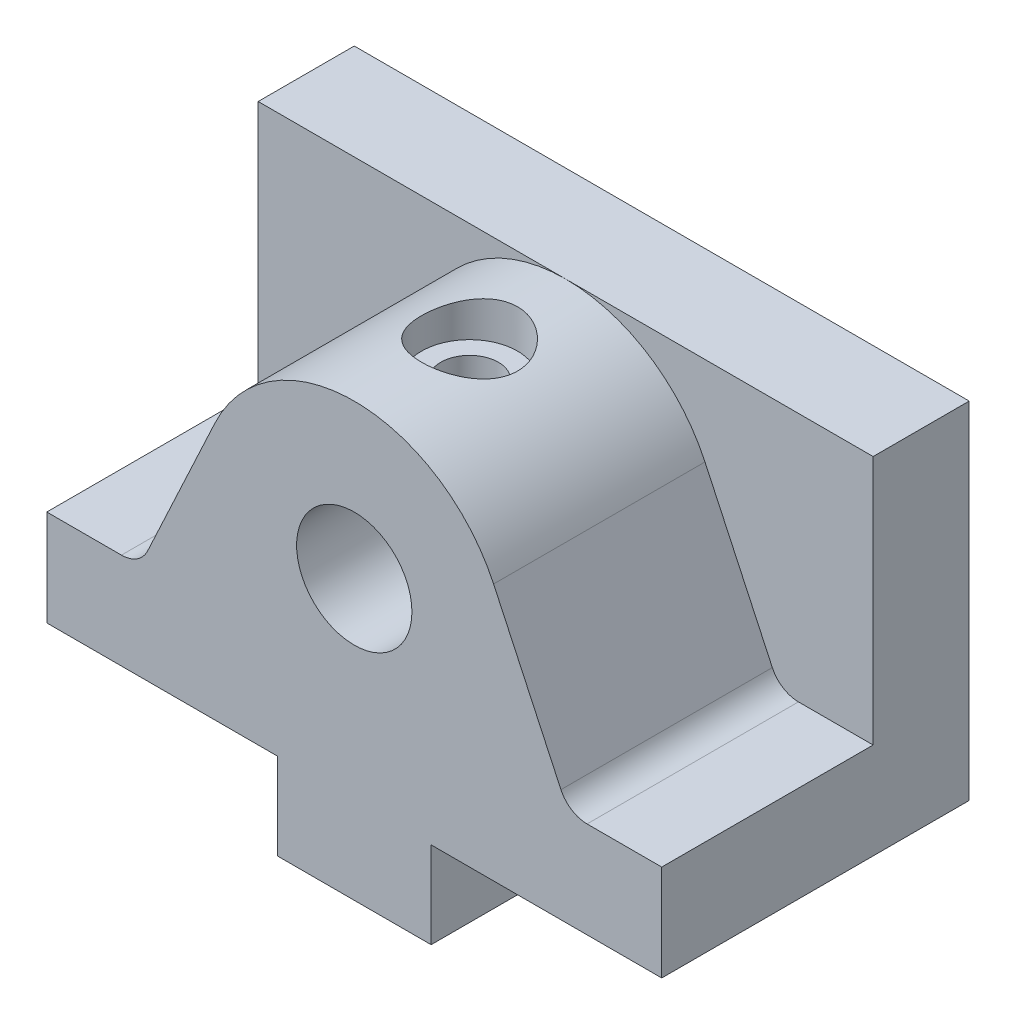
ISO-10303-21;
HEADER;
FILE_DESCRIPTION(('STEP AP214'),'2;1');
FILE_NAME('part.step','',(''),(''),'','','');
FILE_SCHEMA(('AUTOMOTIVE_DESIGN { 1 0 10303 214 1 1 1 1 }'));
ENDSEC;
DATA;
#1=APPLICATION_CONTEXT('core data for automotive mechanical design processes');
#2=APPLICATION_PROTOCOL_DEFINITION('international standard','automotive_design',2000,#1);
#3=PRODUCT_CONTEXT('',#1,'mechanical');
#4=PRODUCT('Part','Part','',(#3));
#5=PRODUCT_RELATED_PRODUCT_CATEGORY('part','',(#4));
#6=PRODUCT_DEFINITION_FORMATION('','',#4);
#7=PRODUCT_DEFINITION_CONTEXT('part definition',#1,'design');
#8=PRODUCT_DEFINITION('design','',#6,#7);
#9=PRODUCT_DEFINITION_SHAPE('','',#8);
#10=(LENGTH_UNIT() NAMED_UNIT(*) SI_UNIT(.MILLI.,.METRE.));
#11=(NAMED_UNIT(*) PLANE_ANGLE_UNIT() SI_UNIT($,.RADIAN.));
#12=(NAMED_UNIT(*) SI_UNIT($,.STERADIAN.) SOLID_ANGLE_UNIT());
#13=UNCERTAINTY_MEASURE_WITH_UNIT(LENGTH_MEASURE(1.E-05),#10,'distance_accuracy_value','');
#14=(GEOMETRIC_REPRESENTATION_CONTEXT(3) GLOBAL_UNCERTAINTY_ASSIGNED_CONTEXT((#13)) GLOBAL_UNIT_ASSIGNED_CONTEXT((#10,
#11,#12)) REPRESENTATION_CONTEXT('',''));
#15=CARTESIAN_POINT('',(0.,0.,0.));
#16=DIRECTION('',(0.,0.,1.));
#17=DIRECTION('',(1.,0.,0.));
#18=AXIS2_PLACEMENT_3D('',#15,#16,#17);
#19=CARTESIAN_POINT('',(48.4459707787607,22.5907271808898,22.));
#20=DIRECTION('',(0.906307787036647,0.422618261740707,0.));
#21=DIRECTION('',(-0.422618261740707,0.906307787036646,0.));
#22=AXIS2_PLACEMENT_3D('',#19,#20,#21);
#23=PLANE('',#22);
#24=DIRECTION('',(0.422618261740707,-0.906307787036647,0.));
#25=VECTOR('',#24,1.);
#26=CARTESIAN_POINT('',(48.4459707787607,22.5907271808898,22.));
#27=LINE('',#26,#25);
#28=CARTESIAN_POINT('',(46.5009245925863,26.7618921878513,22.));
#29=VERTEX_POINT('',#28);
#30=CARTESIAN_POINT('',(53.5094107062625,11.7321452147779,22.));
#31=VERTEX_POINT('',#30);
#32=EDGE_CURVE('E223',#29,#31,#27,.T.);
#33=ORIENTED_EDGE('',*,*,#32,.T.);
#34=DIRECTION('',(0.,0.,-1.));
#35=VECTOR('',#34,1.);
#36=CARTESIAN_POINT('',(53.5094107062625,11.7321452147779,0.));
#37=LINE('',#36,#35);
#38=CARTESIAN_POINT('',(53.5094107062625,11.7321452147779,0.));
#39=VERTEX_POINT('',#38);
#40=EDGE_CURVE('E294',#31,#39,#37,.T.);
#41=ORIENTED_EDGE('',*,*,#40,.T.);
#42=DIRECTION('',(0.422618261740707,-0.906307787036647,0.));
#43=VECTOR('',#42,1.);
#44=CARTESIAN_POINT('',(48.4459707787607,22.5907271808898,0.));
#45=LINE('',#44,#43);
#46=CARTESIAN_POINT('',(46.5009245925863,26.7618921878513,0.));
#47=VERTEX_POINT('',#46);
#48=EDGE_CURVE('E221',#47,#39,#45,.T.);
#49=ORIENTED_EDGE('',*,*,#48,.F.);
#50=DIRECTION('',(0.,0.,-1.));
#51=VECTOR('',#50,1.);
#52=CARTESIAN_POINT('',(46.5009245925863,26.7618921878513,22.));
#53=LINE('',#52,#51);
#54=EDGE_CURVE('E284',#29,#47,#53,.T.);
#55=ORIENTED_EDGE('',*,*,#54,.F.);
#56=EDGE_LOOP('',(#33,#41,#49,#55));
#57=FACE_BOUND('',#56,.T.);
#58=ADVANCED_FACE('F44',(#57),#23,.T.);
#59=CARTESIAN_POINT('',(32.,20.,22.));
#60=DIRECTION('',(0.,0.,-1.));
#61=DIRECTION('',(-1.,0.,0.));
#62=AXIS2_PLACEMENT_3D('',#59,#60,#61);
#63=CYLINDRICAL_SURFACE('',#62,16.);
#64=CARTESIAN_POINT('',(32.,36.,15.));
#65=CARTESIAN_POINT('',(31.7262432593018,35.9999986351195,14.9999982136497));
#66=CARTESIAN_POINT('',(31.4524677899886,35.9929077993933,14.9774430922222));
#67=CARTESIAN_POINT('',(30.9129231616462,35.9653157635526,14.888055033843));
#68=CARTESIAN_POINT('',(30.6471558290963,35.9448115279957,14.8212120745424));
#69=CARTESIAN_POINT('',(30.1314858253969,35.892632627915,14.6457225152172));
#70=CARTESIAN_POINT('',(29.8815592920572,35.860975259956,14.5371406213887));
#71=CARTESIAN_POINT('',(29.4034607906138,35.7897587664487,14.2815307292862));
#72=CARTESIAN_POINT('',(29.1752922582191,35.7501983960149,14.1344966728757));
#73=CARTESIAN_POINT('',(28.7401386601923,35.6660085495921,13.8013760319326));
#74=CARTESIAN_POINT('',(28.5339198873788,35.621268637007,13.6143164597633));
#75=CARTESIAN_POINT('',(28.1552104718466,35.5324018550409,13.2085264303382));
#76=CARTESIAN_POINT('',(27.9827261083849,35.4882751012093,12.9897900899934));
#77=CARTESIAN_POINT('',(27.6722265406936,35.4044457876485,12.5202217447927));
#78=CARTESIAN_POINT('',(27.5351686340689,35.3648795310221,12.2687300899923));
#79=CARTESIAN_POINT('',(27.3056103570076,35.2963120709366,11.7448307401774));
#80=CARTESIAN_POINT('',(27.2130982491415,35.2673080849026,11.4724285768566));
#81=CARTESIAN_POINT('',(27.0780616027814,35.224304279618,10.9230876901663));
#82=CARTESIAN_POINT('',(27.0341155996838,35.2098789171452,10.6465326254318));
#83=CARTESIAN_POINT('',(26.9930177985221,35.1964022056731,10.0896275243652));
#84=CARTESIAN_POINT('',(26.9958535601583,35.1973467694717,9.80927851673902));
#85=CARTESIAN_POINT('',(27.0471270107018,35.2141275626545,9.26450215888891));
#86=CARTESIAN_POINT('',(27.0937576852707,35.229373668447,8.99988349644805));
#87=CARTESIAN_POINT('',(27.2283674658204,35.272081024701,8.48243137375097));
#88=CARTESIAN_POINT('',(27.3163509662281,35.2995435733467,8.2295991691417));
#89=CARTESIAN_POINT('',(27.5324450127348,35.3640417609542,7.73859222230161));
#90=CARTESIAN_POINT('',(27.6611229735129,35.4012113865356,7.5006855572407));
#91=CARTESIAN_POINT('',(27.9545591704899,35.4808742631002,7.04924892847488));
#92=CARTESIAN_POINT('',(28.119326779138,35.523368895754,6.83572531898279));
#93=CARTESIAN_POINT('',(28.4891321832704,35.6112611120491,6.42890022633452));
#94=CARTESIAN_POINT('',(28.6956617176284,35.6567027842357,6.23696176888193));
#95=CARTESIAN_POINT('',(29.1385423676182,35.7436628303753,5.89011242568063));
#96=CARTESIAN_POINT('',(29.374895690604,35.7851809135328,5.735204283123));
#97=CARTESIAN_POINT('',(29.8733415581381,35.8600517956098,5.46588924559509));
#98=CARTESIAN_POINT('',(30.1356203723229,35.8933384259289,5.35180745814418));
#99=CARTESIAN_POINT('',(30.6769280888694,35.9475182331416,5.1697879965937));
#100=CARTESIAN_POINT('',(30.9559518771016,35.9684151730059,5.10183631104642));
#101=CARTESIAN_POINT('',(31.5112593708386,35.9948555758007,5.0163278296841));
#102=CARTESIAN_POINT('',(31.7872326048446,36.0009609158175,4.99692582562591));
#103=CARTESIAN_POINT('',(32.3385212229303,35.9987919892393,5.00386490654933));
#104=CARTESIAN_POINT('',(32.613836697226,35.9905198232454,5.03019930929045));
#105=CARTESIAN_POINT('',(33.1488773319034,35.9608945507905,5.12638237042556));
#106=CARTESIAN_POINT('',(33.4088199136837,35.9398717244275,5.19513307044996));
#107=CARTESIAN_POINT('',(33.9134077154455,35.8872048551716,5.37285740946688));
#108=CARTESIAN_POINT('',(34.1580510417962,35.8555595005738,5.48183601610006));
#109=CARTESIAN_POINT('',(34.6317296266887,35.783941710377,5.73989286619475));
#110=CARTESIAN_POINT('',(34.8602389591512,35.7437850727067,5.88988394998724));
#111=CARTESIAN_POINT('',(35.289463403841,35.6597364001372,6.2246128404697));
#112=CARTESIAN_POINT('',(35.4901709521758,35.6158433539155,6.40936007097857));
#113=CARTESIAN_POINT('',(35.8663498516761,35.5270797953257,6.8170355602084));
#114=CARTESIAN_POINT('',(36.0405060935812,35.4822394682577,7.0411866549569));
#115=CARTESIAN_POINT('',(36.3488500098061,35.3984778838242,7.5165064655071));
#116=CARTESIAN_POINT('',(36.4830383189372,35.3595565324524,7.76767475210794));
#117=CARTESIAN_POINT('',(36.7068033392217,35.2924712932348,8.28938069148191));
#118=CARTESIAN_POINT('',(36.7965527822405,35.264265854275,8.55983859774289));
#119=CARTESIAN_POINT('',(36.9289157727236,35.2220468337724,9.11308997299448));
#120=CARTESIAN_POINT('',(36.9715472565598,35.2080278520491,9.39587870537413));
#121=CARTESIAN_POINT('',(37.007176246325,35.1963317085551,9.95201635032171));
#122=CARTESIAN_POINT('',(37.0023311848654,35.1979441840057,10.2252138153897));
#123=CARTESIAN_POINT('',(36.9483527251533,35.2156036150361,10.7666983397678));
#124=CARTESIAN_POINT('',(36.8992213929005,35.2316498972642,11.0349856275469));
#125=CARTESIAN_POINT('',(36.7595091965447,35.2758725673356,11.5551761583676));
#126=CARTESIAN_POINT('',(36.6695456962403,35.3038679276103,11.8072617643734));
#127=CARTESIAN_POINT('',(36.4512090934,35.3687881701826,12.292961654136));
#128=CARTESIAN_POINT('',(36.3228281777695,35.4057148685869,12.5265721683136));
#129=CARTESIAN_POINT('',(36.0254270005397,35.4861394813401,12.9785838817592));
#130=CARTESIAN_POINT('',(35.8550133409653,35.5298379569183,13.196032518001));
#131=CARTESIAN_POINT('',(35.4808359856192,35.6179599528484,13.599945312448));
#132=CARTESIAN_POINT('',(35.2770633693776,35.6623836642662,13.7864011559642));
#133=CARTESIAN_POINT('',(34.8339466512934,35.7486908780989,14.1291301534517));
#134=CARTESIAN_POINT('',(34.5936582979495,35.7904440692269,14.2842189457998));
#135=CARTESIAN_POINT('',(34.0891165520546,35.8650707718751,14.5515956605578));
#136=CARTESIAN_POINT('',(33.8248726311818,35.8979477726329,14.6639004085673));
#137=CARTESIAN_POINT('',(33.3029905414959,35.9488260293388,14.8343654704338));
#138=CARTESIAN_POINT('',(33.0466813484502,35.9678496322456,14.8962994692213));
#139=CARTESIAN_POINT('',(32.526919581761,35.9934360136194,14.9791134398709));
#140=CARTESIAN_POINT('',(32.2634684645587,36.0000013135858,15.000001719216));
#141=CARTESIAN_POINT('',(32.,36.,15.));
#142=B_SPLINE_CURVE_WITH_KNOTS('',3,(#64,#65,#66,#67,#68,#69,#70,#71,#72,#73,#74,#75,#76,#77,
#78,#79,#80,#81,#82,#83,#84,#85,#86,#87,#88,#89,#90,#91,#92,#93,#94,#95,#96,#97,#98,#99,#100,
#101,#102,#103,#104,#105,#106,#107,#108,#109,#110,#111,#112,#113,#114,#115,#116,#117,#118,#119,
#120,#121,#122,#123,#124,#125,#126,#127,#128,#129,#130,#131,#132,#133,#134,#135,#136,#137,#138,
#139,#140,#141),.UNSPECIFIED.,.T.,.F.,(4,2,2,2,2,2,2,2,2,2,2,2,2,2,2,2,2,2,2,2,2,2,2,2,2,2,2,2,
2,2,2,2,2,2,2,2,2,2,4),(0.,0.820301797730038,1.64078929339626,2.46000991680974,3.27935968623355,
4.12151288780632,4.96382269725104,5.82695084991452,6.68985145121462,7.52676600672194,
8.36345801183907,9.16707669695193,9.97078079925599,10.7862257089153,11.6018826405078,
12.4546698912775,13.3075202966256,14.1670184276843,15.0262553798756,15.8523027420229,
16.678229426068,17.4836250690084,18.2891202014734,19.1142529896272,19.9396098284638,
20.7976711486191,21.6557188394419,22.5104046302277,23.364764955987,24.1804881394266,
24.9961732705187,25.7999165363422,26.6038233736823,27.4391805607298,28.274761495409,
29.1376267255318,30.0001522671288,30.789785466537,31.5792588309973),.UNSPECIFIED.);
#143=CARTESIAN_POINT('',(32.,36.,15.));
#144=VERTEX_POINT('',#143);
#145=EDGE_CURVE('E13',#144,#144,#142,.T.);
#146=ORIENTED_EDGE('',*,*,#145,.T.);
#147=EDGE_LOOP('',(#146));
#148=FACE_BOUND('',#147,.T.);
#149=CARTESIAN_POINT('',(32.,20.,0.));
#150=DIRECTION('',(0.,0.,1.));
#151=DIRECTION('',(1.,0.,0.));
#152=AXIS2_PLACEMENT_3D('',#149,#150,#151);
#153=CIRCLE('',#152,16.);
#154=CARTESIAN_POINT('',(32.,36.,0.));
#155=VERTEX_POINT('',#154);
#156=EDGE_CURVE('E255',#47,#155,#153,.T.);
#157=ORIENTED_EDGE('',*,*,#156,.T.);
#158=CARTESIAN_POINT('',(17.4990754074136,26.7618921878511,0.));
#159=VERTEX_POINT('',#158);
#160=EDGE_CURVE('E254',#155,#159,#153,.T.);
#161=ORIENTED_EDGE('',*,*,#160,.T.);
#162=DIRECTION('',(0.,0.,-1.));
#163=VECTOR('',#162,1.);
#164=CARTESIAN_POINT('',(17.4990754074136,26.7618921878511,22.));
#165=LINE('',#164,#163);
#166=CARTESIAN_POINT('',(17.4990754074136,26.7618921878511,22.));
#167=VERTEX_POINT('',#166);
#168=EDGE_CURVE('E281',#167,#159,#165,.T.);
#169=ORIENTED_EDGE('',*,*,#168,.F.);
#170=CARTESIAN_POINT('',(32.,20.,22.));
#171=DIRECTION('',(0.,0.,1.));
#172=DIRECTION('',(1.,0.,0.));
#173=AXIS2_PLACEMENT_3D('',#170,#171,#172);
#174=CIRCLE('',#173,16.);
#175=EDGE_CURVE('E226',#29,#167,#174,.T.);
#176=ORIENTED_EDGE('',*,*,#175,.F.);
#177=ORIENTED_EDGE('',*,*,#54,.T.);
#178=EDGE_LOOP('',(#157,#161,#169,#176,#177));
#179=FACE_BOUND('',#178,.T.);
#180=ADVANCED_FACE('F322',(#148,#179),#63,.T.);
#181=CARTESIAN_POINT('',(4.12323273120865,-1.92269499891791,22.));
#182=DIRECTION('',(0.906307787036653,-0.422618261740694,0.));
#183=DIRECTION('',(0.422618261740694,0.906307787036653,0.));
#184=AXIS2_PLACEMENT_3D('',#181,#182,#183);
#185=PLANE('',#184);
#186=DIRECTION('',(-0.422618261740694,-0.906307787036653,0.));
#187=VECTOR('',#186,1.);
#188=CARTESIAN_POINT('',(4.12323273120865,-1.92269499891791,0.));
#189=LINE('',#188,#187);
#190=CARTESIAN_POINT('',(10.4905892937377,11.7321452147779,0.));
#191=VERTEX_POINT('',#190);
#192=EDGE_CURVE('E258',#159,#191,#189,.T.);
#193=ORIENTED_EDGE('',*,*,#192,.T.);
#194=DIRECTION('',(0.,0.,-1.));
#195=VECTOR('',#194,1.);
#196=CARTESIAN_POINT('',(10.4905892937377,11.7321452147779,22.));
#197=LINE('',#196,#195);
#198=CARTESIAN_POINT('',(10.4905892937377,11.7321452147779,22.));
#199=VERTEX_POINT('',#198);
#200=EDGE_CURVE('E292',#191,#199,#197,.F.);
#201=ORIENTED_EDGE('',*,*,#200,.T.);
#202=DIRECTION('',(-0.422618261740694,-0.906307787036653,0.));
#203=VECTOR('',#202,1.);
#204=CARTESIAN_POINT('',(4.12323273120865,-1.92269499891791,22.));
#205=LINE('',#204,#203);
#206=EDGE_CURVE('E229',#167,#199,#205,.T.);
#207=ORIENTED_EDGE('',*,*,#206,.F.);
#208=ORIENTED_EDGE('',*,*,#168,.T.);
#209=EDGE_LOOP('',(#193,#201,#207,#208));
#210=FACE_BOUND('',#209,.T.);
#211=ADVANCED_FACE('F327',(#210),#185,.F.);
#212=CARTESIAN_POINT('',(0.,10.,22.));
#213=DIRECTION('',(0.,1.,0.));
#214=DIRECTION('',(0.,0.,1.));
#215=AXIS2_PLACEMENT_3D('',#212,#213,#214);
#216=PLANE('',#215);
#217=DIRECTION('',(1.,0.,0.));
#218=VECTOR('',#217,1.);
#219=CARTESIAN_POINT('',(0.,10.,22.));
#220=LINE('',#219,#218);
#221=CARTESIAN_POINT('',(0.,10.,22.));
#222=VERTEX_POINT('',#221);
#223=CARTESIAN_POINT('',(7.77166593262779,10.,22.));
#224=VERTEX_POINT('',#223);
#225=EDGE_CURVE('E232',#222,#224,#220,.T.);
#226=ORIENTED_EDGE('',*,*,#225,.T.);
#227=DIRECTION('',(0.,0.,-1.));
#228=VECTOR('',#227,1.);
#229=CARTESIAN_POINT('',(7.77166593262779,10.,22.));
#230=LINE('',#229,#228);
#231=CARTESIAN_POINT('',(7.77166593262779,10.,0.));
#232=VERTEX_POINT('',#231);
#233=EDGE_CURVE('E287',#224,#232,#230,.T.);
#234=ORIENTED_EDGE('',*,*,#233,.T.);
#235=DIRECTION('',(1.,0.,0.));
#236=VECTOR('',#235,1.);
#237=CARTESIAN_POINT('',(0.,10.,0.));
#238=LINE('',#237,#236);
#239=CARTESIAN_POINT('',(0.,10.,0.));
#240=VERTEX_POINT('',#239);
#241=EDGE_CURVE('E261',#240,#232,#238,.T.);
#242=ORIENTED_EDGE('',*,*,#241,.F.);
#243=DIRECTION('',(0.,0.,-1.));
#244=VECTOR('',#243,1.);
#245=CARTESIAN_POINT('',(0.,10.,22.));
#246=LINE('',#245,#244);
#247=EDGE_CURVE('E278',#222,#240,#246,.T.);
#248=ORIENTED_EDGE('',*,*,#247,.F.);
#249=EDGE_LOOP('',(#226,#234,#242,#248));
#250=FACE_BOUND('',#249,.T.);
#251=ADVANCED_FACE('F333',(#250),#216,.T.);
#252=CARTESIAN_POINT('',(0.,0.,22.));
#253=DIRECTION('',(-1.,0.,0.));
#254=DIRECTION('',(0.,0.,1.));
#255=AXIS2_PLACEMENT_3D('',#252,#253,#254);
#256=PLANE('',#255);
#257=ORIENTED_EDGE('',*,*,#247,.T.);
#258=DIRECTION('',(0.,1.,0.));
#259=VECTOR('',#258,1.);
#260=CARTESIAN_POINT('',(0.,0.,0.));
#261=LINE('',#260,#259);
#262=CARTESIAN_POINT('',(0.,36.,0.));
#263=VERTEX_POINT('',#262);
#264=EDGE_CURVE('E195',#240,#263,#261,.T.);
#265=ORIENTED_EDGE('',*,*,#264,.T.);
#266=DIRECTION('',(0.,0.,1.));
#267=VECTOR('',#266,1.);
#268=CARTESIAN_POINT('',(0.,36.,-10.));
#269=LINE('',#268,#267);
#270=CARTESIAN_POINT('',(0.,36.,-10.));
#271=VERTEX_POINT('',#270);
#272=EDGE_CURVE('E188',#271,#263,#269,.T.);
#273=ORIENTED_EDGE('',*,*,#272,.F.);
#274=DIRECTION('',(0.,1.,0.));
#275=VECTOR('',#274,1.);
#276=CARTESIAN_POINT('',(0.,0.,-10.));
#277=LINE('',#276,#275);
#278=CARTESIAN_POINT('',(0.,0.,-10.));
#279=VERTEX_POINT('',#278);
#280=EDGE_CURVE('E174',#279,#271,#277,.T.);
#281=ORIENTED_EDGE('',*,*,#280,.F.);
#282=DIRECTION('',(0.,0.,-1.));
#283=VECTOR('',#282,1.);
#284=CARTESIAN_POINT('',(0.,0.,22.));
#285=LINE('',#284,#283);
#286=CARTESIAN_POINT('',(0.,0.,22.));
#287=VERTEX_POINT('',#286);
#288=EDGE_CURVE('E276',#287,#279,#285,.T.);
#289=ORIENTED_EDGE('',*,*,#288,.F.);
#290=DIRECTION('',(0.,1.,0.));
#291=VECTOR('',#290,1.);
#292=CARTESIAN_POINT('',(0.,0.,22.));
#293=LINE('',#292,#291);
#294=EDGE_CURVE('E235',#287,#222,#293,.T.);
#295=ORIENTED_EDGE('',*,*,#294,.T.);
#296=EDGE_LOOP('',(#257,#265,#273,#281,#289,#295));
#297=FACE_BOUND('',#296,.T.);
#298=ADVANCED_FACE('F335',(#297),#256,.T.);
#299=CARTESIAN_POINT('',(0.,0.,22.));
#300=DIRECTION('',(0.,1.,0.));
#301=DIRECTION('',(0.,0.,1.));
#302=AXIS2_PLACEMENT_3D('',#299,#300,#301);
#303=PLANE('',#302);
#304=ORIENTED_EDGE('',*,*,#288,.T.);
#305=DIRECTION('',(1.,0.,0.));
#306=VECTOR('',#305,1.);
#307=CARTESIAN_POINT('',(0.,0.,-10.));
#308=LINE('',#307,#306);
#309=CARTESIAN_POINT('',(24.,0.,-10.));
#310=VERTEX_POINT('',#309);
#311=EDGE_CURVE('E204',#279,#310,#308,.T.);
#312=ORIENTED_EDGE('',*,*,#311,.T.);
#313=DIRECTION('',(0.,0.,-1.));
#314=VECTOR('',#313,1.);
#315=CARTESIAN_POINT('',(24.,0.,22.));
#316=LINE('',#315,#314);
#317=CARTESIAN_POINT('',(24.,0.,22.));
#318=VERTEX_POINT('',#317);
#319=EDGE_CURVE('E274',#318,#310,#316,.T.);
#320=ORIENTED_EDGE('',*,*,#319,.F.);
#321=DIRECTION('',(1.,0.,0.));
#322=VECTOR('',#321,1.);
#323=CARTESIAN_POINT('',(0.,0.,22.));
#324=LINE('',#323,#322);
#325=EDGE_CURVE('E239',#287,#318,#324,.T.);
#326=ORIENTED_EDGE('',*,*,#325,.F.);
#327=EDGE_LOOP('',(#304,#312,#320,#326));
#328=FACE_BOUND('',#327,.T.);
#329=ADVANCED_FACE('F338',(#328),#303,.F.);
#330=CARTESIAN_POINT('',(24.,0.,22.));
#331=DIRECTION('',(1.,0.,0.));
#332=DIRECTION('',(0.,0.,-1.));
#333=AXIS2_PLACEMENT_3D('',#330,#331,#332);
#334=PLANE('',#333);
#335=ORIENTED_EDGE('',*,*,#319,.T.);
#336=DIRECTION('',(0.,-1.,0.));
#337=VECTOR('',#336,1.);
#338=CARTESIAN_POINT('',(24.,0.,-10.));
#339=LINE('',#338,#337);
#340=CARTESIAN_POINT('',(24.,-9.,-10.));
#341=VERTEX_POINT('',#340);
#342=EDGE_CURVE('E207',#310,#341,#339,.T.);
#343=ORIENTED_EDGE('',*,*,#342,.T.);
#344=DIRECTION('',(0.,0.,-1.));
#345=VECTOR('',#344,1.);
#346=CARTESIAN_POINT('',(24.,-9.,22.));
#347=LINE('',#346,#345);
#348=CARTESIAN_POINT('',(24.,-9.,22.));
#349=VERTEX_POINT('',#348);
#350=EDGE_CURVE('E272',#349,#341,#347,.T.);
#351=ORIENTED_EDGE('',*,*,#350,.F.);
#352=DIRECTION('',(0.,-1.,0.));
#353=VECTOR('',#352,1.);
#354=CARTESIAN_POINT('',(24.,0.,22.));
#355=LINE('',#354,#353);
#356=EDGE_CURVE('E241',#318,#349,#355,.T.);
#357=ORIENTED_EDGE('',*,*,#356,.F.);
#358=EDGE_LOOP('',(#335,#343,#351,#357));
#359=FACE_BOUND('',#358,.T.);
#360=ADVANCED_FACE('F342',(#359),#334,.F.);
#361=CARTESIAN_POINT('',(0.,-9.,22.));
#362=DIRECTION('',(0.,1.,0.));
#363=DIRECTION('',(-1.,0.,0.));
#364=AXIS2_PLACEMENT_3D('',#361,#362,#363);
#365=PLANE('',#364);
#366=CARTESIAN_POINT('',(32.,-9.,-2.));
#367=DIRECTION('',(0.,-1.,0.));
#368=DIRECTION('',(1.,0.,0.));
#369=AXIS2_PLACEMENT_3D('',#366,#367,#368);
#370=CIRCLE('',#369,3.);
#371=CARTESIAN_POINT('',(35.,-9.,-2.));
#372=VERTEX_POINT('',#371);
#373=EDGE_CURVE('E408',#372,#372,#370,.T.);
#374=ORIENTED_EDGE('',*,*,#373,.F.);
#375=EDGE_LOOP('',(#374));
#376=FACE_BOUND('',#375,.T.);
#377=CARTESIAN_POINT('',(32.,-9.,14.));
#378=DIRECTION('',(0.,-1.,0.));
#379=DIRECTION('',(1.,0.,0.));
#380=AXIS2_PLACEMENT_3D('',#377,#378,#379);
#381=CIRCLE('',#380,3.);
#382=CARTESIAN_POINT('',(35.,-9.,14.));
#383=VERTEX_POINT('',#382);
#384=EDGE_CURVE('E414',#383,#383,#381,.T.);
#385=ORIENTED_EDGE('',*,*,#384,.F.);
#386=EDGE_LOOP('',(#385));
#387=FACE_BOUND('',#386,.T.);
#388=ORIENTED_EDGE('',*,*,#350,.T.);
#389=DIRECTION('',(1.,0.,0.));
#390=VECTOR('',#389,1.);
#391=CARTESIAN_POINT('',(0.,-9.,-10.));
#392=LINE('',#391,#390);
#393=CARTESIAN_POINT('',(40.,-9.,-10.));
#394=VERTEX_POINT('',#393);
#395=EDGE_CURVE('E210',#341,#394,#392,.T.);
#396=ORIENTED_EDGE('',*,*,#395,.T.);
#397=DIRECTION('',(0.,0.,-1.));
#398=VECTOR('',#397,1.);
#399=CARTESIAN_POINT('',(40.,-9.,22.));
#400=LINE('',#399,#398);
#401=CARTESIAN_POINT('',(40.,-9.,22.));
#402=VERTEX_POINT('',#401);
#403=EDGE_CURVE('E270',#402,#394,#400,.T.);
#404=ORIENTED_EDGE('',*,*,#403,.F.);
#405=DIRECTION('',(1.,0.,0.));
#406=VECTOR('',#405,1.);
#407=CARTESIAN_POINT('',(0.,-9.,22.));
#408=LINE('',#407,#406);
#409=EDGE_CURVE('E243',#349,#402,#408,.T.);
#410=ORIENTED_EDGE('',*,*,#409,.F.);
#411=EDGE_LOOP('',(#388,#396,#404,#410));
#412=FACE_BOUND('',#411,.T.);
#413=ADVANCED_FACE('F346',(#376,#387,#412),#365,.F.);
#414=CARTESIAN_POINT('',(40.,0.,22.));
#415=DIRECTION('',(1.,0.,0.));
#416=DIRECTION('',(0.,0.,-1.));
#417=AXIS2_PLACEMENT_3D('',#414,#415,#416);
#418=PLANE('',#417);
#419=ORIENTED_EDGE('',*,*,#403,.T.);
#420=DIRECTION('',(0.,-1.,0.));
#421=VECTOR('',#420,1.);
#422=CARTESIAN_POINT('',(40.,0.,-10.));
#423=LINE('',#422,#421);
#424=CARTESIAN_POINT('',(40.,0.,-10.));
#425=VERTEX_POINT('',#424);
#426=EDGE_CURVE('E213',#425,#394,#423,.T.);
#427=ORIENTED_EDGE('',*,*,#426,.F.);
#428=DIRECTION('',(0.,0.,-1.));
#429=VECTOR('',#428,1.);
#430=CARTESIAN_POINT('',(40.,0.,22.));
#431=LINE('',#430,#429);
#432=CARTESIAN_POINT('',(40.,0.,22.));
#433=VERTEX_POINT('',#432);
#434=EDGE_CURVE('E268',#433,#425,#431,.T.);
#435=ORIENTED_EDGE('',*,*,#434,.F.);
#436=DIRECTION('',(0.,-1.,0.));
#437=VECTOR('',#436,1.);
#438=CARTESIAN_POINT('',(40.,0.,22.));
#439=LINE('',#438,#437);
#440=EDGE_CURVE('E245',#433,#402,#439,.T.);
#441=ORIENTED_EDGE('',*,*,#440,.T.);
#442=EDGE_LOOP('',(#419,#427,#435,#441));
#443=FACE_BOUND('',#442,.T.);
#444=ADVANCED_FACE('F350',(#443),#418,.T.);
#445=CARTESIAN_POINT('',(0.,0.,22.));
#446=DIRECTION('',(0.,1.,0.));
#447=DIRECTION('',(0.,0.,1.));
#448=AXIS2_PLACEMENT_3D('',#445,#446,#447);
#449=PLANE('',#448);
#450=ORIENTED_EDGE('',*,*,#434,.T.);
#451=DIRECTION('',(1.,0.,0.));
#452=VECTOR('',#451,1.);
#453=CARTESIAN_POINT('',(0.,0.,-10.));
#454=LINE('',#453,#452);
#455=CARTESIAN_POINT('',(64.,0.,-10.));
#456=VERTEX_POINT('',#455);
#457=EDGE_CURVE('E189',#425,#456,#454,.T.);
#458=ORIENTED_EDGE('',*,*,#457,.T.);
#459=DIRECTION('',(0.,0.,-1.));
#460=VECTOR('',#459,1.);
#461=CARTESIAN_POINT('',(64.,0.,22.));
#462=LINE('',#461,#460);
#463=CARTESIAN_POINT('',(64.,0.,22.));
#464=VERTEX_POINT('',#463);
#465=EDGE_CURVE('E194',#464,#456,#462,.T.);
#466=ORIENTED_EDGE('',*,*,#465,.F.);
#467=DIRECTION('',(1.,0.,0.));
#468=VECTOR('',#467,1.);
#469=CARTESIAN_POINT('',(0.,0.,22.));
#470=LINE('',#469,#468);
#471=EDGE_CURVE('E248',#433,#464,#470,.T.);
#472=ORIENTED_EDGE('',*,*,#471,.F.);
#473=EDGE_LOOP('',(#450,#458,#466,#472));
#474=FACE_BOUND('',#473,.T.);
#475=ADVANCED_FACE('F354',(#474),#449,.F.);
#476=CARTESIAN_POINT('',(64.,0.,22.));
#477=DIRECTION('',(-1.,0.,0.));
#478=DIRECTION('',(0.,0.,1.));
#479=AXIS2_PLACEMENT_3D('',#476,#477,#478);
#480=PLANE('',#479);
#481=ORIENTED_EDGE('',*,*,#465,.T.);
#482=DIRECTION('',(0.,1.,0.));
#483=VECTOR('',#482,1.);
#484=CARTESIAN_POINT('',(64.,0.,-10.));
#485=LINE('',#484,#483);
#486=CARTESIAN_POINT('',(64.,36.,-10.));
#487=VERTEX_POINT('',#486);
#488=EDGE_CURVE('E170',#456,#487,#485,.T.);
#489=ORIENTED_EDGE('',*,*,#488,.T.);
#490=DIRECTION('',(0.,0.,1.));
#491=VECTOR('',#490,1.);
#492=CARTESIAN_POINT('',(64.,36.,-10.));
#493=LINE('',#492,#491);
#494=CARTESIAN_POINT('',(64.,36.,0.));
#495=VERTEX_POINT('',#494);
#496=EDGE_CURVE('E180',#487,#495,#493,.T.);
#497=ORIENTED_EDGE('',*,*,#496,.T.);
#498=DIRECTION('',(0.,1.,0.));
#499=VECTOR('',#498,1.);
#500=CARTESIAN_POINT('',(64.,0.,0.));
#501=LINE('',#500,#499);
#502=CARTESIAN_POINT('',(64.,10.,0.));
#503=VERTEX_POINT('',#502);
#504=EDGE_CURVE('E217',#503,#495,#501,.T.);
#505=ORIENTED_EDGE('',*,*,#504,.F.);
#506=DIRECTION('',(0.,0.,-1.));
#507=VECTOR('',#506,1.);
#508=CARTESIAN_POINT('',(64.,10.,22.));
#509=LINE('',#508,#507);
#510=CARTESIAN_POINT('',(64.,10.,22.));
#511=VERTEX_POINT('',#510);
#512=EDGE_CURVE('E264',#511,#503,#509,.T.);
#513=ORIENTED_EDGE('',*,*,#512,.F.);
#514=DIRECTION('',(0.,1.,0.));
#515=VECTOR('',#514,1.);
#516=CARTESIAN_POINT('',(64.,0.,22.));
#517=LINE('',#516,#515);
#518=EDGE_CURVE('E250',#464,#511,#517,.T.);
#519=ORIENTED_EDGE('',*,*,#518,.F.);
#520=EDGE_LOOP('',(#481,#489,#497,#505,#513,#519));
#521=FACE_BOUND('',#520,.T.);
#522=ADVANCED_FACE('F191',(#521),#480,.F.);
#523=CARTESIAN_POINT('',(56.2283340673725,10.,0.));
#524=VERTEX_POINT('',#523);
#525=EDGE_CURVE('E227',#524,#503,#238,.T.);
#526=ORIENTED_EDGE('',*,*,#525,.F.);
#527=DIRECTION('',(0.,0.,-1.));
#528=VECTOR('',#527,1.);
#529=CARTESIAN_POINT('',(56.2283340673725,10.,22.));
#530=LINE('',#529,#528);
#531=CARTESIAN_POINT('',(56.2283340673725,10.,22.));
#532=VERTEX_POINT('',#531);
#533=EDGE_CURVE('E64',#524,#532,#530,.F.);
#534=ORIENTED_EDGE('',*,*,#533,.T.);
#535=EDGE_CURVE('E236',#532,#511,#220,.T.);
#536=ORIENTED_EDGE('',*,*,#535,.T.);
#537=ORIENTED_EDGE('',*,*,#512,.T.);
#538=EDGE_LOOP('',(#526,#534,#536,#537));
#539=FACE_BOUND('',#538,.T.);
#540=ADVANCED_FACE('F361',(#539),#216,.T.);
#541=CARTESIAN_POINT('',(0.,0.,22.));
#542=DIRECTION('',(0.,0.,1.));
#543=DIRECTION('',(1.,0.,0.));
#544=AXIS2_PLACEMENT_3D('',#541,#542,#543);
#545=PLANE('',#544);
#546=CARTESIAN_POINT('',(32.,20.,22.));
#547=DIRECTION('',(0.,0.,1.));
#548=DIRECTION('',(1.,0.,0.));
#549=AXIS2_PLACEMENT_3D('',#546,#547,#548);
#550=CIRCLE('',#549,6.);
#551=CARTESIAN_POINT('',(38.,20.,22.));
#552=VERTEX_POINT('',#551);
#553=EDGE_CURVE('E200',#552,#552,#550,.T.);
#554=ORIENTED_EDGE('',*,*,#553,.F.);
#555=EDGE_LOOP('',(#554));
#556=FACE_BOUND('',#555,.T.);
#557=ORIENTED_EDGE('',*,*,#32,.F.);
#558=ORIENTED_EDGE('',*,*,#175,.T.);
#559=ORIENTED_EDGE('',*,*,#206,.T.);
#560=CARTESIAN_POINT('',(7.77166593262779,13.,22.));
#561=DIRECTION('',(0.,0.,1.));
#562=DIRECTION('',(1.,0.,0.));
#563=AXIS2_PLACEMENT_3D('',#560,#561,#562);
#564=CIRCLE('',#563,3.);
#565=EDGE_CURVE('E299',#199,#224,#564,.F.);
#566=ORIENTED_EDGE('',*,*,#565,.T.);
#567=ORIENTED_EDGE('',*,*,#225,.F.);
#568=ORIENTED_EDGE('',*,*,#294,.F.);
#569=ORIENTED_EDGE('',*,*,#325,.T.);
#570=ORIENTED_EDGE('',*,*,#356,.T.);
#571=ORIENTED_EDGE('',*,*,#409,.T.);
#572=ORIENTED_EDGE('',*,*,#440,.F.);
#573=ORIENTED_EDGE('',*,*,#471,.T.);
#574=ORIENTED_EDGE('',*,*,#518,.T.);
#575=ORIENTED_EDGE('',*,*,#535,.F.);
#576=CARTESIAN_POINT('',(56.2283340673725,13.,22.));
#577=DIRECTION('',(0.,0.,1.));
#578=DIRECTION('',(1.,0.,0.));
#579=AXIS2_PLACEMENT_3D('',#576,#577,#578);
#580=CIRCLE('',#579,3.);
#581=EDGE_CURVE('E57',#532,#31,#580,.F.);
#582=ORIENTED_EDGE('',*,*,#581,.T.);
#583=EDGE_LOOP('',(#557,#558,#559,#566,#567,#568,#569,#570,#571,#572,#573,#574,#575,#582));
#584=FACE_BOUND('',#583,.T.);
#585=ADVANCED_FACE('F303',(#556,#584),#545,.T.);
#586=CARTESIAN_POINT('',(0.,0.,0.));
#587=DIRECTION('',(0.,0.,1.));
#588=DIRECTION('',(1.,0.,0.));
#589=AXIS2_PLACEMENT_3D('',#586,#587,#588);
#590=PLANE('',#589);
#591=ORIENTED_EDGE('',*,*,#48,.T.);
#592=CARTESIAN_POINT('',(56.2283340673725,13.,0.));
#593=DIRECTION('',(0.,0.,1.));
#594=DIRECTION('',(1.,0.,0.));
#595=AXIS2_PLACEMENT_3D('',#592,#593,#594);
#596=CIRCLE('',#595,3.);
#597=EDGE_CURVE('E72',#39,#524,#596,.T.);
#598=ORIENTED_EDGE('',*,*,#597,.T.);
#599=ORIENTED_EDGE('',*,*,#525,.T.);
#600=ORIENTED_EDGE('',*,*,#504,.T.);
#601=DIRECTION('',(1.,0.,0.));
#602=VECTOR('',#601,1.);
#603=CARTESIAN_POINT('',(0.,36.,0.));
#604=LINE('',#603,#602);
#605=EDGE_CURVE('E184',#155,#495,#604,.T.);
#606=ORIENTED_EDGE('',*,*,#605,.F.);
#607=ORIENTED_EDGE('',*,*,#156,.F.);
#608=EDGE_LOOP('',(#591,#598,#599,#600,#606,#607));
#609=FACE_BOUND('',#608,.T.);
#610=ADVANCED_FACE('F366',(#609),#590,.T.);
#611=CARTESIAN_POINT('',(0.,36.,-10.));
#612=DIRECTION('',(0.,-1.,0.));
#613=DIRECTION('',(0.,0.,-1.));
#614=AXIS2_PLACEMENT_3D('',#611,#612,#613);
#615=PLANE('',#614);
#616=EDGE_CURVE('E197',#263,#155,#604,.T.);
#617=ORIENTED_EDGE('',*,*,#616,.T.);
#618=ORIENTED_EDGE('',*,*,#605,.T.);
#619=ORIENTED_EDGE('',*,*,#496,.F.);
#620=DIRECTION('',(1.,0.,0.));
#621=VECTOR('',#620,1.);
#622=CARTESIAN_POINT('',(0.,36.,-10.));
#623=LINE('',#622,#621);
#624=EDGE_CURVE('E165',#271,#487,#623,.T.);
#625=ORIENTED_EDGE('',*,*,#624,.F.);
#626=ORIENTED_EDGE('',*,*,#272,.T.);
#627=EDGE_LOOP('',(#617,#618,#619,#625,#626));
#628=FACE_BOUND('',#627,.T.);
#629=ADVANCED_FACE('F182',(#628),#615,.F.);
#630=CARTESIAN_POINT('',(0.,0.,-10.));
#631=DIRECTION('',(0.,0.,1.));
#632=DIRECTION('',(1.,0.,0.));
#633=AXIS2_PLACEMENT_3D('',#630,#631,#632);
#634=PLANE('',#633);
#635=ORIENTED_EDGE('',*,*,#488,.F.);
#636=ORIENTED_EDGE('',*,*,#457,.F.);
#637=ORIENTED_EDGE('',*,*,#426,.T.);
#638=ORIENTED_EDGE('',*,*,#395,.F.);
#639=ORIENTED_EDGE('',*,*,#342,.F.);
#640=ORIENTED_EDGE('',*,*,#311,.F.);
#641=ORIENTED_EDGE('',*,*,#280,.T.);
#642=ORIENTED_EDGE('',*,*,#624,.T.);
#643=EDGE_LOOP('',(#635,#636,#637,#638,#639,#640,#641,#642));
#644=FACE_BOUND('',#643,.T.);
#645=ADVANCED_FACE('F167',(#644),#634,.F.);
#646=ORIENTED_EDGE('',*,*,#241,.T.);
#647=CARTESIAN_POINT('',(7.77166593262779,13.,0.));
#648=DIRECTION('',(0.,0.,1.));
#649=DIRECTION('',(1.,0.,0.));
#650=AXIS2_PLACEMENT_3D('',#647,#648,#649);
#651=CIRCLE('',#650,3.);
#652=EDGE_CURVE('E290',#232,#191,#651,.T.);
#653=ORIENTED_EDGE('',*,*,#652,.T.);
#654=ORIENTED_EDGE('',*,*,#192,.F.);
#655=ORIENTED_EDGE('',*,*,#160,.F.);
#656=ORIENTED_EDGE('',*,*,#616,.F.);
#657=ORIENTED_EDGE('',*,*,#264,.F.);
#658=EDGE_LOOP('',(#646,#653,#654,#655,#656,#657));
#659=FACE_BOUND('',#658,.T.);
#660=ADVANCED_FACE('F319',(#659),#590,.T.);
#661=CARTESIAN_POINT('',(7.77166593262779,13.,22.));
#662=DIRECTION('',(0.,0.,-1.));
#663=DIRECTION('',(-1.,0.,0.));
#664=AXIS2_PLACEMENT_3D('',#661,#662,#663);
#665=CYLINDRICAL_SURFACE('',#664,3.);
#666=ORIENTED_EDGE('',*,*,#565,.F.);
#667=ORIENTED_EDGE('',*,*,#200,.F.);
#668=ORIENTED_EDGE('',*,*,#652,.F.);
#669=ORIENTED_EDGE('',*,*,#233,.F.);
#670=EDGE_LOOP('',(#666,#667,#668,#669));
#671=FACE_BOUND('',#670,.T.);
#672=ADVANCED_FACE('F311',(#671),#665,.F.);
#673=CARTESIAN_POINT('',(56.2283340673725,13.,22.));
#674=DIRECTION('',(0.,0.,1.));
#675=DIRECTION('',(1.,0.,0.));
#676=AXIS2_PLACEMENT_3D('',#673,#674,#675);
#677=CYLINDRICAL_SURFACE('',#676,3.);
#678=ORIENTED_EDGE('',*,*,#581,.F.);
#679=ORIENTED_EDGE('',*,*,#533,.F.);
#680=ORIENTED_EDGE('',*,*,#597,.F.);
#681=ORIENTED_EDGE('',*,*,#40,.F.);
#682=EDGE_LOOP('',(#678,#679,#680,#681));
#683=FACE_BOUND('',#682,.T.);
#684=ADVANCED_FACE('F46',(#683),#677,.F.);
#685=CARTESIAN_POINT('',(32.,20.,-2.));
#686=DIRECTION('',(0.,0.,1.));
#687=DIRECTION('',(1.,0.,0.));
#688=AXIS2_PLACEMENT_3D('',#685,#686,#687);
#689=CYLINDRICAL_SURFACE('',#688,6.);
#690=CARTESIAN_POINT('',(32.,26.,13.));
#691=CARTESIAN_POINT('',(32.0788941476271,25.9999993496415,12.9999991612595));
#692=CARTESIAN_POINT('',(32.157796620408,25.9984386900238,12.9968820545245));
#693=CARTESIAN_POINT('',(32.3150019912559,25.9922435879326,12.98446072826));
#694=CARTESIAN_POINT('',(32.3933046036205,25.987607762957,12.9751537259346));
#695=CARTESIAN_POINT('',(32.6266286913737,25.9692197802747,12.9380421431814));
#696=CARTESIAN_POINT('',(32.779952894845,25.950987344555,12.9010471709373));
#697=CARTESIAN_POINT('',(33.07683586336,25.9044896674308,12.8044182255708));
#698=CARTESIAN_POINT('',(33.2204300548438,25.8762634436568,12.7448722337916));
#699=CARTESIAN_POINT('',(33.4954082051538,25.8123730271633,12.6052887493211));
#700=CARTESIAN_POINT('',(33.6267931255915,25.7767094209369,12.5252528722967));
#701=CARTESIAN_POINT('',(33.8825270127178,25.6986875229893,12.3414460191505));
#702=CARTESIAN_POINT('',(34.0059694541685,25.6560547458661,12.2365320524786));
#703=CARTESIAN_POINT('',(34.2343345109019,25.5698003362933,12.0084440785134));
#704=CARTESIAN_POINT('',(34.3392430135573,25.5261779786051,11.8852562868347));
#705=CARTESIAN_POINT('',(34.5357686472225,25.4389634796958,11.6125156399183));
#706=CARTESIAN_POINT('',(34.625724111766,25.3956360268673,11.4616590255418));
#707=CARTESIAN_POINT('',(34.7403403145029,25.3378244971939,11.2240491459768));
#708=CARTESIAN_POINT('',(34.7751678688212,25.3197457084025,11.1429290754373));
#709=CARTESIAN_POINT('',(34.8376929959649,25.2866576836529,10.9773994201196));
#710=CARTESIAN_POINT('',(34.8653947808394,25.2716466354339,10.8929918127424));
#711=CARTESIAN_POINT('',(34.9118828026651,25.2461034170808,10.7266042032378));
#712=CARTESIAN_POINT('',(34.9311004229291,25.235358385652,10.6447772032435));
#713=CARTESIAN_POINT('',(34.9626355938468,25.2175778415115,10.4794450914804));
#714=CARTESIAN_POINT('',(34.9749568053511,25.2105403608213,10.3959408944593));
#715=CARTESIAN_POINT('',(34.9925138241271,25.2004775664527,10.2279936325838));
#716=CARTESIAN_POINT('',(34.9977538985794,25.1974498364711,10.1435511641063));
#717=CARTESIAN_POINT('',(35.0010845241606,25.1955255596719,9.97450634565856));
#718=CARTESIAN_POINT('',(34.9991757574161,25.1966286187036,9.88990401171214));
#719=CARTESIAN_POINT('',(34.984049735404,25.2053466805927,9.65724610167769));
#720=CARTESIAN_POINT('',(34.9633504263272,25.2172679435374,9.50975584584563));
#721=CARTESIAN_POINT('',(34.9008228003669,25.2522818241212,9.22080632317494));
#722=CARTESIAN_POINT('',(34.858987752956,25.2753780002338,9.07934899304936));
#723=CARTESIAN_POINT('',(34.7546284393731,25.3306256888873,8.80232034970317));
#724=CARTESIAN_POINT('',(34.6916449587032,25.36297559568,8.66696288824886));
#725=CARTESIAN_POINT('',(34.547125305758,25.4331017525131,8.40809503668597));
#726=CARTESIAN_POINT('',(34.4655808000752,25.4708804371131,8.28459000351952));
#727=CARTESIAN_POINT('',(34.2741980873975,25.5533948568688,8.0364369062202));
#728=CARTESIAN_POINT('',(34.1620833543489,25.5984053392498,7.9136295576159));
#729=CARTESIAN_POINT('',(33.918666756993,25.6864286668495,7.68779356579794));
#730=CARTESIAN_POINT('',(33.7873557754036,25.7294405499668,7.58477437509415));
#731=CARTESIAN_POINT('',(33.501549511551,25.8110596276946,7.39694306798137));
#732=CARTESIAN_POINT('',(33.3462607732106,25.8493695273188,7.31319859630242));
#733=CARTESIAN_POINT('',(33.0213986480528,25.9147364311806,7.17370889924219));
#734=CARTESIAN_POINT('',(32.8518367292037,25.9418023676751,7.11794144145035));
#735=CARTESIAN_POINT('',(32.518299474608,25.9797300128223,7.04057379206389));
#736=CARTESIAN_POINT('',(32.3550245915451,25.9917481491937,7.01652629361826));
#737=CARTESIAN_POINT('',(32.0263387999479,26.0021904036188,6.99560580573833));
#738=CARTESIAN_POINT('',(31.8609289404157,26.0006209616012,6.99871994286048));
#739=CARTESIAN_POINT('',(31.5463010840186,25.9847357676384,7.0306200654602));
#740=CARTESIAN_POINT('',(31.3968217758449,25.9714173706497,7.05739759824394));
#741=CARTESIAN_POINT('',(31.1047793230995,25.9346651394405,7.13271421563139));
#742=CARTESIAN_POINT('',(30.9622169429247,25.911230190049,7.18125569934861));
#743=CARTESIAN_POINT('',(30.6833341746534,25.8555275423906,7.2999953993113));
#744=CARTESIAN_POINT('',(30.547308808997,25.8230264530147,7.37077315034128));
#745=CARTESIAN_POINT('',(30.2886159148878,25.7523192295968,7.53132260694728));
#746=CARTESIAN_POINT('',(30.1659541106149,25.7141106672883,7.62110240382872));
#747=CARTESIAN_POINT('',(29.9246969321952,25.6312466397789,7.82728127594372));
#748=CARTESIAN_POINT('',(29.8076837667844,25.5863265441049,7.94542860514478));
#749=CARTESIAN_POINT('',(29.594431036987,25.497871747068,8.1997754536848));
#750=CARTESIAN_POINT('',(29.4982058431315,25.4543380217028,8.3359873565804));
#751=CARTESIAN_POINT('',(29.324876256283,25.3715357665078,8.63093096248033));
#752=CARTESIAN_POINT('',(29.2489235118298,25.3325758876393,8.79043379796256));
#753=CARTESIAN_POINT('',(29.1257515229644,25.2672221688566,9.12253020304536));
#754=CARTESIAN_POINT('',(29.0784952551916,25.2408121470948,9.29510658064319));
#755=CARTESIAN_POINT('',(29.0184149350748,25.2068450303742,9.63073066753086));
#756=CARTESIAN_POINT('',(29.002721001798,25.1977215024558,9.79310275629027));
#757=CARTESIAN_POINT('',(28.9979325458531,25.1949606407435,10.1183412055073));
#758=CARTESIAN_POINT('',(29.0088264935271,25.2013165943727,10.2812073211427));
#759=CARTESIAN_POINT('',(29.0542215930048,25.227135856483,10.5864504910934));
#760=CARTESIAN_POINT('',(29.0863749492186,25.2452928164687,10.7293013622656));
#761=CARTESIAN_POINT('',(29.1704740331137,25.2911305036464,11.0074244064572));
#762=CARTESIAN_POINT('',(29.2224261275027,25.3188142941166,11.142694125528));
#763=CARTESIAN_POINT('',(29.3485523361757,25.3828558394063,11.4118743616646));
#764=CARTESIAN_POINT('',(29.4239849401192,25.4196713966662,11.5450829694789));
#765=CARTESIAN_POINT('',(29.5935487323799,25.4970602244007,11.7978243449357));
#766=CARTESIAN_POINT('',(29.6876896487924,25.5376354439705,11.9173499464044));
#767=CARTESIAN_POINT('',(29.905383108708,25.6238685394751,12.1544228574881));
#768=CARTESIAN_POINT('',(30.0311194781661,25.6695449437195,12.2699651241614));
#769=CARTESIAN_POINT('',(30.3015628492296,25.7563371235633,12.478801140071));
#770=CARTESIAN_POINT('',(30.4462800114982,25.7974504345613,12.5720828970222));
#771=CARTESIAN_POINT('',(30.6754766646659,25.8525140684199,12.6931781845566));
#772=CARTESIAN_POINT('',(30.7542468522421,25.8698252424274,12.7305202002416));
#773=CARTESIAN_POINT('',(30.9152027450728,25.9016884596254,12.7983616788238));
#774=CARTESIAN_POINT('',(30.9973867519462,25.9162418552376,12.8288644970335));
#775=CARTESIAN_POINT('',(31.1643830020843,25.9421269018512,12.8826072559925));
#776=CARTESIAN_POINT('',(31.2491890598693,25.9534655761548,12.905863040764));
#777=CARTESIAN_POINT('',(31.4208576425916,25.9726077187874,12.9448825727806));
#778=CARTESIAN_POINT('',(31.5077188771745,25.9804133464694,12.9606508965564));
#779=CARTESIAN_POINT('',(31.6621751046845,25.9908582985537,12.9816846786135));
#780=CARTESIAN_POINT('',(31.7295048379047,25.9942803541452,12.988546917726));
#781=CARTESIAN_POINT('',(31.8645543286182,25.9988515153836,12.9977050014431));
#782=CARTESIAN_POINT('',(31.9322740968251,26.0000005582938,13.0000007200085));
#783=CARTESIAN_POINT('',(32.,26.,13.));
#784=B_SPLINE_CURVE_WITH_KNOTS('',3,(#690,#691,#692,#693,#694,#695,#696,#697,#698,#699,#700,
#701,#702,#703,#704,#705,#706,#707,#708,#709,#710,#711,#712,#713,#714,#715,#716,#717,#718,#719,
#720,#721,#722,#723,#724,#725,#726,#727,#728,#729,#730,#731,#732,#733,#734,#735,#736,#737,#738,
#739,#740,#741,#742,#743,#744,#745,#746,#747,#748,#749,#750,#751,#752,#753,#754,#755,#756,#757,
#758,#759,#760,#761,#762,#763,#764,#765,#766,#767,#768,#769,#770,#771,#772,#773,#774,#775,#776,
#777,#778,#779,#780,#781,#782,#783),.UNSPECIFIED.,.T.,.F.,(4,2,2,2,2,2,2,2,2,2,2,2,2,2,2,2,2,2,
2,2,2,2,2,2,2,2,2,2,2,2,2,2,2,2,2,2,2,2,2,2,2,2,2,2,2,2,4),(0.,0.236611432443577,
0.473329310437698,0.947100987304414,1.41904300465371,1.89094781992153,2.39140181433109,
2.89223525113893,3.4319083310994,3.70192714967837,3.97178599119154,4.2256372003331,
4.47935352842581,4.73291689564224,4.98645606901569,5.43238672147391,5.87845946700878,
6.33492255429305,6.79159098704508,7.30616358925478,7.82098138719902,8.35970601567164,
8.89800185660682,9.3917140633788,9.88519228458271,10.3404225444221,10.7957029981664,
11.2640010300754,11.7324988716886,12.2470036685629,12.7618630076938,13.3016558140826,
13.8407507075944,14.3280945743223,14.8152271451712,15.2559532566965,15.6968212128814,
16.1673090526395,16.6380421835398,17.1659726319345,17.6941868506379,17.9605054214138,
18.2266930489272,18.4922945660822,18.7577335310501,18.9608446764332,19.1639614277477),.UNSPECIFIED.);
#785=CARTESIAN_POINT('',(32.,26.,13.));
#786=VERTEX_POINT('',#785);
#787=EDGE_CURVE('E401',#786,#786,#784,.T.);
#788=ORIENTED_EDGE('',*,*,#787,.T.);
#789=EDGE_LOOP('',(#788));
#790=FACE_BOUND('',#789,.T.);
#791=CARTESIAN_POINT('',(32.,20.,-2.));
#792=DIRECTION('',(0.,0.,1.));
#793=DIRECTION('',(1.,0.,0.));
#794=AXIS2_PLACEMENT_3D('',#791,#792,#793);
#795=CIRCLE('',#794,6.);
#796=CARTESIAN_POINT('',(38.,20.,-2.));
#797=VERTEX_POINT('',#796);
#798=EDGE_CURVE('E219',#797,#797,#795,.T.);
#799=ORIENTED_EDGE('',*,*,#798,.F.);
#800=EDGE_LOOP('',(#799));
#801=FACE_BOUND('',#800,.T.);
#802=ORIENTED_EDGE('',*,*,#553,.T.);
#803=EDGE_LOOP('',(#802));
#804=FACE_BOUND('',#803,.T.);
#805=ADVANCED_FACE('F310',(#790,#801,#804),#689,.F.);
#806=CARTESIAN_POINT('',(32.,20.,-2.));
#807=DIRECTION('',(0.,0.,1.));
#808=DIRECTION('',(1.,0.,0.));
#809=AXIS2_PLACEMENT_3D('',#806,#807,#808);
#810=PLANE('',#809);
#811=ORIENTED_EDGE('',*,*,#798,.T.);
#812=EDGE_LOOP('',(#811));
#813=FACE_BOUND('',#812,.T.);
#814=ADVANCED_FACE('F316',(#813),#810,.T.);
#815=CARTESIAN_POINT('',(32.,7.,14.));
#816=DIRECTION('',(0.,-1.,0.));
#817=DIRECTION('',(1.,0.,0.));
#818=AXIS2_PLACEMENT_3D('',#815,#816,#817);
#819=CYLINDRICAL_SURFACE('',#818,3.);
#820=CARTESIAN_POINT('',(32.,7.,14.));
#821=DIRECTION('',(0.,-1.,0.));
#822=DIRECTION('',(1.,0.,0.));
#823=AXIS2_PLACEMENT_3D('',#820,#821,#822);
#824=CIRCLE('',#823,3.);
#825=CARTESIAN_POINT('',(35.,7.,14.));
#826=VERTEX_POINT('',#825);
#827=EDGE_CURVE('E417',#826,#826,#824,.T.);
#828=ORIENTED_EDGE('',*,*,#827,.F.);
#829=EDGE_LOOP('',(#828));
#830=FACE_BOUND('',#829,.T.);
#831=ORIENTED_EDGE('',*,*,#384,.T.);
#832=EDGE_LOOP('',(#831));
#833=FACE_BOUND('',#832,.T.);
#834=ADVANCED_FACE('F377',(#830,#833),#819,.F.);
#835=CARTESIAN_POINT('',(32.,7.,14.));
#836=DIRECTION('',(0.,-1.,0.));
#837=DIRECTION('',(1.,0.,0.));
#838=AXIS2_PLACEMENT_3D('',#835,#836,#837);
#839=PLANE('',#838);
#840=ORIENTED_EDGE('',*,*,#827,.T.);
#841=EDGE_LOOP('',(#840));
#842=FACE_BOUND('',#841,.T.);
#843=ADVANCED_FACE('F381',(#842),#839,.T.);
#844=CARTESIAN_POINT('',(32.,7.,-2.));
#845=DIRECTION('',(0.,-1.,0.));
#846=DIRECTION('',(1.,0.,0.));
#847=AXIS2_PLACEMENT_3D('',#844,#845,#846);
#848=CYLINDRICAL_SURFACE('',#847,3.);
#849=CARTESIAN_POINT('',(32.,7.,-2.));
#850=DIRECTION('',(0.,-1.,0.));
#851=DIRECTION('',(1.,0.,0.));
#852=AXIS2_PLACEMENT_3D('',#849,#850,#851);
#853=CIRCLE('',#852,3.);
#854=CARTESIAN_POINT('',(35.,7.,-2.));
#855=VERTEX_POINT('',#854);
#856=EDGE_CURVE('E411',#855,#855,#853,.T.);
#857=ORIENTED_EDGE('',*,*,#856,.F.);
#858=EDGE_LOOP('',(#857));
#859=FACE_BOUND('',#858,.T.);
#860=ORIENTED_EDGE('',*,*,#373,.T.);
#861=EDGE_LOOP('',(#860));
#862=FACE_BOUND('',#861,.T.);
#863=ADVANCED_FACE('F385',(#859,#862),#848,.F.);
#864=CARTESIAN_POINT('',(32.,7.,-2.));
#865=DIRECTION('',(0.,-1.,0.));
#866=DIRECTION('',(1.,0.,0.));
#867=AXIS2_PLACEMENT_3D('',#864,#865,#866);
#868=PLANE('',#867);
#869=ORIENTED_EDGE('',*,*,#856,.T.);
#870=EDGE_LOOP('',(#869));
#871=FACE_BOUND('',#870,.T.);
#872=ADVANCED_FACE('F389',(#871),#868,.T.);
#873=CARTESIAN_POINT('',(32.,36.,10.));
#874=DIRECTION('',(0.,1.,0.));
#875=DIRECTION('',(0.,0.,1.));
#876=AXIS2_PLACEMENT_3D('',#873,#874,#875);
#877=CYLINDRICAL_SURFACE('',#876,4.99999999999999);
#878=CARTESIAN_POINT('',(32.,32.,10.));
#879=DIRECTION('',(0.,1.,0.));
#880=DIRECTION('',(0.,0.,1.));
#881=AXIS2_PLACEMENT_3D('',#878,#879,#880);
#882=CIRCLE('',#881,4.99999999999999);
#883=CARTESIAN_POINT('',(32.,32.,15.));
#884=VERTEX_POINT('',#883);
#885=EDGE_CURVE('E593',#884,#884,#882,.T.);
#886=ORIENTED_EDGE('',*,*,#885,.F.);
#887=EDGE_LOOP('',(#886));
#888=FACE_BOUND('',#887,.T.);
#889=ORIENTED_EDGE('',*,*,#145,.F.);
#890=EDGE_LOOP('',(#889));
#891=FACE_BOUND('',#890,.T.);
#892=ADVANCED_FACE('F393',(#888,#891),#877,.F.);
#893=CARTESIAN_POINT('',(32.,36.,10.));
#894=DIRECTION('',(0.,1.,0.));
#895=DIRECTION('',(0.,0.,1.));
#896=AXIS2_PLACEMENT_3D('',#893,#894,#895);
#897=CYLINDRICAL_SURFACE('',#896,3.);
#898=ORIENTED_EDGE('',*,*,#787,.F.);
#899=EDGE_LOOP('',(#898));
#900=FACE_BOUND('',#899,.T.);
#901=CARTESIAN_POINT('',(32.,32.,10.));
#902=DIRECTION('',(0.,1.,0.));
#903=DIRECTION('',(0.,0.,1.));
#904=AXIS2_PLACEMENT_3D('',#901,#902,#903);
#905=CIRCLE('',#904,3.00000000000001);
#906=CARTESIAN_POINT('',(32.,32.,13.));
#907=VERTEX_POINT('',#906);
#908=EDGE_CURVE('E409',#907,#907,#905,.T.);
#909=ORIENTED_EDGE('',*,*,#908,.T.);
#910=EDGE_LOOP('',(#909));
#911=FACE_BOUND('',#910,.T.);
#912=ADVANCED_FACE('F397',(#900,#911),#897,.F.);
#913=CARTESIAN_POINT('',(35.,32.,10.));
#914=DIRECTION('',(0.,-1.,0.));
#915=DIRECTION('',(0.,0.,-1.));
#916=AXIS2_PLACEMENT_3D('',#913,#914,#915);
#917=PLANE('',#916);
#918=ORIENTED_EDGE('',*,*,#908,.F.);
#919=EDGE_LOOP('',(#918));
#920=FACE_BOUND('',#919,.T.);
#921=ORIENTED_EDGE('',*,*,#885,.T.);
#922=EDGE_LOOP('',(#921));
#923=FACE_BOUND('',#922,.T.);
#924=ADVANCED_FACE('F569',(#920,#923),#917,.F.);
#925=CLOSED_SHELL('',(#58,#180,#211,#251,#298,#329,#360,#413,#444,#475,#522,#540,#585,#610,#629,
#645,#660,#672,#684,#805,#814,#834,#843,#863,#872,#892,#912,#924));
#926=MANIFOLD_SOLID_BREP('B2',#925);
#927=ADVANCED_BREP_SHAPE_REPRESENTATION('',(#18,#926),#14);
#928=SHAPE_DEFINITION_REPRESENTATION(#9,#927);
ENDSEC;
END-ISO-10303-21;
